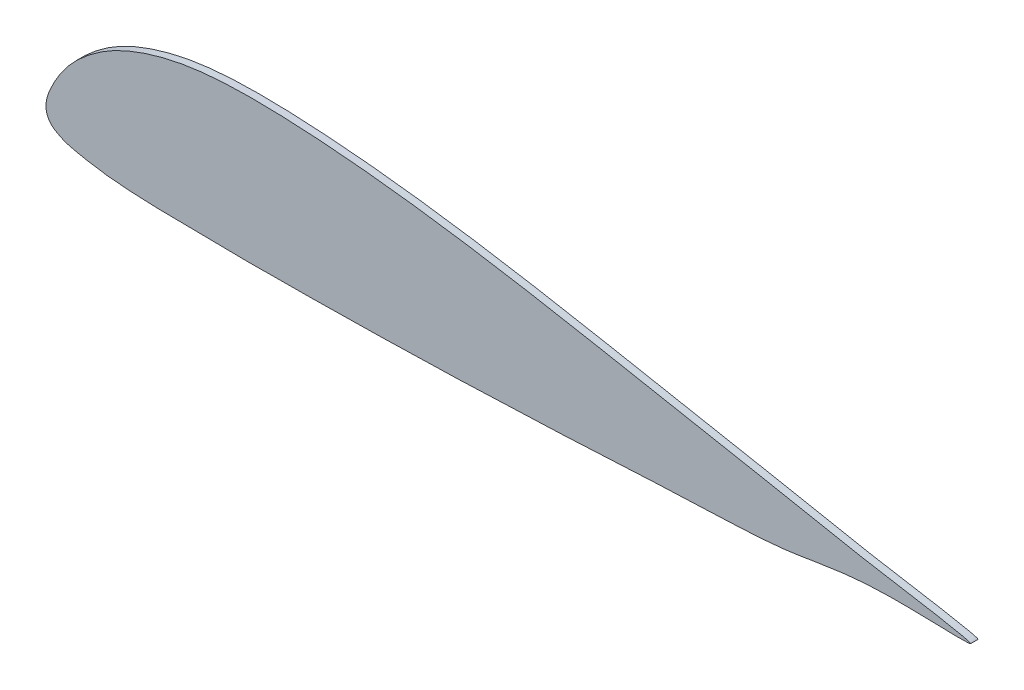
ISO-10303-21;
HEADER;
FILE_DESCRIPTION(('STEP AP214'),'2;1');
FILE_NAME('part.step','',(''),(''),'','','');
FILE_SCHEMA(('AUTOMOTIVE_DESIGN { 1 0 10303 214 1 1 1 1 }'));
ENDSEC;
DATA;
#1=APPLICATION_CONTEXT('core data for automotive mechanical design processes');
#2=APPLICATION_PROTOCOL_DEFINITION('international standard','automotive_design',2000,#1);
#3=PRODUCT_CONTEXT('',#1,'mechanical');
#4=PRODUCT('Part','Part','',(#3));
#5=PRODUCT_RELATED_PRODUCT_CATEGORY('part','',(#4));
#6=PRODUCT_DEFINITION_FORMATION('','',#4);
#7=PRODUCT_DEFINITION_CONTEXT('part definition',#1,'design');
#8=PRODUCT_DEFINITION('design','',#6,#7);
#9=PRODUCT_DEFINITION_SHAPE('','',#8);
#10=(LENGTH_UNIT() NAMED_UNIT(*) SI_UNIT(.MILLI.,.METRE.));
#11=(NAMED_UNIT(*) PLANE_ANGLE_UNIT() SI_UNIT($,.RADIAN.));
#12=(NAMED_UNIT(*) SI_UNIT($,.STERADIAN.) SOLID_ANGLE_UNIT());
#13=UNCERTAINTY_MEASURE_WITH_UNIT(LENGTH_MEASURE(1.E-05),#10,'distance_accuracy_value','');
#14=(GEOMETRIC_REPRESENTATION_CONTEXT(3) GLOBAL_UNCERTAINTY_ASSIGNED_CONTEXT((#13)) GLOBAL_UNIT_ASSIGNED_CONTEXT((#10,
#11,#12)) REPRESENTATION_CONTEXT('',''));
#15=CARTESIAN_POINT('',(0.,0.,0.));
#16=DIRECTION('',(0.,0.,1.));
#17=DIRECTION('',(1.,0.,0.));
#18=AXIS2_PLACEMENT_3D('',#15,#16,#17);
#19=CARTESIAN_POINT('',(0.,0.,4.));
#20=DIRECTION('',(0.,0.,1.));
#21=DIRECTION('',(1.,0.,0.));
#22=AXIS2_PLACEMENT_3D('',#19,#20,#21);
#23=PLANE('',#22);
#24=CARTESIAN_POINT('',(7.86642818865798,37.5600854439552,4.));
#25=CARTESIAN_POINT('',(9.349195933155,39.7790656142948,4.));
#26=CARTESIAN_POINT('',(12.1034873252235,43.4755174120012,4.));
#27=CARTESIAN_POINT('',(16.9159359850114,48.5150404115486,4.));
#28=CARTESIAN_POINT('',(21.6176664375762,52.7069461570158,4.));
#29=CARTESIAN_POINT('',(26.6421593711908,56.5455689477406,4.));
#30=CARTESIAN_POINT('',(31.6626790734477,59.9068258486715,4.));
#31=CARTESIAN_POINT('',(36.9892194583104,62.9566992776115,4.));
#32=CARTESIAN_POINT('',(42.8619342983418,65.7826347722417,4.));
#33=CARTESIAN_POINT('',(49.0168378634112,68.2730208695513,4.));
#34=CARTESIAN_POINT('',(55.447830013006,70.4815511522718,4.));
#35=CARTESIAN_POINT('',(61.4971824775569,72.2302159766422,4.));
#36=CARTESIAN_POINT('',(68.0467453758925,73.8176998488306,4.));
#37=CARTESIAN_POINT('',(74.3978940088024,75.0510161003253,4.));
#38=CARTESIAN_POINT('',(80.8824820776991,76.0082542537129,4.));
#39=CARTESIAN_POINT('',(86.7438296997499,76.6696660731231,4.));
#40=CARTESIAN_POINT('',(93.1858587450397,77.1992714433523,4.));
#41=CARTESIAN_POINT('',(100.873467483866,77.5954456385825,4.));
#42=CARTESIAN_POINT('',(109.531029416945,77.7729608456838,4.));
#43=CARTESIAN_POINT('',(119.540449473351,77.7055762504231,4.));
#44=CARTESIAN_POINT('',(130.116670866595,77.3864475790961,4.));
#45=CARTESIAN_POINT('',(141.13642380684,76.837588784259,4.));
#46=CARTESIAN_POINT('',(151.918170621868,76.1211915889756,4.));
#47=CARTESIAN_POINT('',(163.323143637899,75.2000149519219,4.));
#48=CARTESIAN_POINT('',(175.958123105388,73.986961570067,4.));
#49=CARTESIAN_POINT('',(190.05754678027,72.4144741651409,4.));
#50=CARTESIAN_POINT('',(206.582344436751,70.3224944013891,4.));
#51=CARTESIAN_POINT('',(223.84999875408,67.8567628620006,4.));
#52=CARTESIAN_POINT('',(240.490370609623,65.2434318976702,4.));
#53=CARTESIAN_POINT('',(253.817395036374,63.0165517950123,4.));
#54=CARTESIAN_POINT('',(268.670487025287,60.4320915434448,4.));
#55=CARTESIAN_POINT('',(285.232031151819,57.4255088951261,4.));
#56=CARTESIAN_POINT('',(303.893779285959,53.9257087932409,4.));
#57=CARTESIAN_POINT('',(320.011133364715,50.8601080714792,4.));
#58=CARTESIAN_POINT('',(334.611432617956,48.0737237896853,4.));
#59=CARTESIAN_POINT('',(347.931865552968,45.5390866245231,4.));
#60=CARTESIAN_POINT('',(362.655250182307,42.7653845916359,4.));
#61=CARTESIAN_POINT('',(376.820025472643,40.1027299479941,4.));
#62=CARTESIAN_POINT('',(391.306330775227,37.3495779188942,4.));
#63=CARTESIAN_POINT('',(404.141083587299,34.8486521829418,4.));
#64=CARTESIAN_POINT('',(419.345736353988,31.8103993496776,4.));
#65=CARTESIAN_POINT('',(436.363954130895,28.5257555347518,4.));
#66=CARTESIAN_POINT('',(455.999670421156,25.1096296023083,4.));
#67=CARTESIAN_POINT('',(476.567739047917,21.5773552750827,4.));
#68=CARTESIAN_POINT('',(486.734086076748,19.9980658019803,4.));
#69=CARTESIAN_POINT('',(503.19953596373,16.4828473280323,4.));
#70=CARTESIAN_POINT('',(494.0454434377,16.0789705033464,4.));
#71=CARTESIAN_POINT('',(487.893099972618,16.3456510718054,4.));
#72=CARTESIAN_POINT('',(477.38296715892,16.5667793245295,4.));
#73=CARTESIAN_POINT('',(465.767026362275,16.8137990808104,4.));
#74=CARTESIAN_POINT('',(452.74352490968,16.8186367949743,4.));
#75=CARTESIAN_POINT('',(439.174137539788,16.1147428039849,4.));
#76=CARTESIAN_POINT('',(425.264325471383,14.4642529434865,4.));
#77=CARTESIAN_POINT('',(412.041731394213,12.2109073669242,4.));
#78=CARTESIAN_POINT('',(396.927202205353,9.953910023902,4.));
#79=CARTESIAN_POINT('',(381.325737555321,8.81453684115407,4.));
#80=CARTESIAN_POINT('',(365.963725518706,8.18860884489088,4.));
#81=CARTESIAN_POINT('',(351.799027155226,7.70612388226326,4.));
#82=CARTESIAN_POINT('',(338.72259128266,7.14953840348512,4.));
#83=CARTESIAN_POINT('',(326.138738131588,6.50563477890456,4.));
#84=CARTESIAN_POINT('',(315.786058686714,5.95049010015145,4.));
#85=CARTESIAN_POINT('',(307.253260403638,5.49156980855069,4.));
#86=CARTESIAN_POINT('',(297.411514352509,4.97962602862121,4.));
#87=CARTESIAN_POINT('',(286.856508578636,4.47136369606796,4.));
#88=CARTESIAN_POINT('',(277.288264205225,4.04393621337987,4.));
#89=CARTESIAN_POINT('',(269.185495432717,3.6963464667102,4.));
#90=CARTESIAN_POINT('',(261.455408329635,3.37510162961061,4.));
#91=CARTESIAN_POINT('',(251.85847367848,2.9904005185695,4.));
#92=CARTESIAN_POINT('',(241.259764138997,2.57538695252416,4.));
#93=CARTESIAN_POINT('',(231.97931917217,2.22730813543466,4.));
#94=CARTESIAN_POINT('',(223.450553441865,1.92592357604687,4.));
#95=CARTESIAN_POINT('',(216.537698653368,1.69541028667778,4.));
#96=CARTESIAN_POINT('',(207.316113689005,1.41133055741081,4.));
#97=CARTESIAN_POINT('',(198.265588962476,1.16951598795194,4.));
#98=CARTESIAN_POINT('',(188.832044810454,0.960506400865428,4.));
#99=CARTESIAN_POINT('',(181.194391153829,0.811797962890729,4.));
#100=CARTESIAN_POINT('',(173.300774393552,0.674971798142655,4.));
#101=CARTESIAN_POINT('',(165.598027616176,0.553110888651061,4.));
#102=CARTESIAN_POINT('',(157.184877056438,0.427740206675201,4.));
#103=CARTESIAN_POINT('',(148.255486381539,0.296373140235194,4.));
#104=CARTESIAN_POINT('',(137.665890196127,0.139932701420909,4.));
#105=CARTESIAN_POINT('',(127.332975975454,0.0246894512117235,4.));
#106=CARTESIAN_POINT('',(116.035852958917,-0.0122939360525976,4.));
#107=CARTESIAN_POINT('',(106.2760960558,0.0230099384918485,4.));
#108=CARTESIAN_POINT('',(96.7774624087549,0.100882580030632,4.));
#109=CARTESIAN_POINT('',(88.6912158704019,0.18914004370334,4.));
#110=CARTESIAN_POINT('',(80.0667024231119,0.303091928359447,4.));
#111=CARTESIAN_POINT('',(71.5319385885235,0.422867632545606,4.));
#112=CARTESIAN_POINT('',(61.8978591166734,0.593225650239152,4.));
#113=CARTESIAN_POINT('',(53.0113701516594,0.862691355569765,4.));
#114=CARTESIAN_POINT('',(44.0349476770185,1.33412077346498,4.));
#115=CARTESIAN_POINT('',(36.2172914452283,1.95952021144231,4.));
#116=CARTESIAN_POINT('',(28.3052008260824,2.91165829366469,4.));
#117=CARTESIAN_POINT('',(21.1380626609549,4.15286774,4.));
#118=CARTESIAN_POINT('',(14.9806404589297,5.47597874074992,4.));
#119=CARTESIAN_POINT('',(10.1274482430046,6.70931718640755,4.));
#120=CARTESIAN_POINT('',(6.49526205462328,8.52310688643919,4.));
#121=CARTESIAN_POINT('',(3.41688364341468,10.3580600486565,4.));
#122=CARTESIAN_POINT('',(1.23618206270726,12.9218454266941,4.));
#123=CARTESIAN_POINT('',(0.0422916903364493,16.1496423344682,4.));
#124=CARTESIAN_POINT('',(-0.107746475681622,19.6682563157669,4.));
#125=CARTESIAN_POINT('',(0.84874716288435,24.1335431540118,4.));
#126=CARTESIAN_POINT('',(2.84809809058963,28.6746958250691,4.));
#127=CARTESIAN_POINT('',(5.205494886095,33.3883456706554,4.));
#128=CARTESIAN_POINT('',(6.93859153057243,36.171566471077,4.));
#129=CARTESIAN_POINT('',(7.86642818865798,37.5600854439552,4.));
#130=B_SPLINE_CURVE_WITH_KNOTS('',3,(#24,#25,#26,#27,#28,#29,#30,#31,#32,#33,#34,#35,#36,#37,
#38,#39,#40,#41,#42,#43,#44,#45,#46,#47,#48,#49,#50,#51,#52,#53,#54,#55,#56,#57,#58,#59,#60,#61,
#62,#63,#64,#65,#66,#67,#68,#69,#70,#71,#72,#73,#74,#75,#76,#77,#78,#79,#80,#81,#82,#83,#84,#85,
#86,#87,#88,#89,#90,#91,#92,#93,#94,#95,#96,#97,#98,#99,#100,#101,#102,#103,#104,#105,#106,#107,
#108,#109,#110,#111,#112,#113,#114,#115,#116,#117,#118,#119,#120,#121,#122,#123,#124,#125,#126,
#127,#128,#129),.UNSPECIFIED.,.T.,.F.,(4,1,1,1,1,1,1,1,1,1,1,1,1,1,1,1,1,1,1,1,1,1,1,1,1,1,1,1,
1,1,1,1,1,1,1,1,1,1,1,1,1,1,1,1,1,1,1,1,1,1,1,1,1,1,1,1,1,1,1,1,1,1,1,1,1,1,1,1,1,1,1,1,1,1,1,1,
1,1,1,1,1,1,1,1,1,1,1,1,1,1,1,1,1,1,1,1,1,1,1,1,1,1,1,4),(0.,0.00770697235470337,
0.0132882265489208,0.0201143121464451,0.0258932716103778,0.0315518965906807,0.0375663195534116,
0.0436184091143941,0.0503760137734859,0.056745984115085,0.0632649535575923,0.0685696268475672,
0.0762213431590591,0.0819558506627911,0.0875123859970355,0.0932680044431737,0.100636625052185,
0.109759073664857,0.118293518714106,0.129566794260679,0.140340402301577,0.150183662476812,
0.160798709594957,0.173412414770068,0.186871093706961,0.201803840898713,0.22155642795299,
0.237286489293352,0.250490924136068,0.26061142648175,0.280863818400143,0.299143426523571,
0.315492967610378,0.328285759759526,0.342106856472102,0.354686027268743,0.371592203373484,
0.383765331725917,0.397312234619457,0.409371574840389,0.428650667193576,0.447017705102968,
0.468574147879851,0.482904754889232,0.490873644478574,0.494014251499779,0.502595482342349,
0.5118452316674,0.523193048031028,0.536597071894935,0.549342877759212,0.562479896614475,
0.577046941202727,0.588116309420885,0.606637017505124,0.622219343293856,0.632561704986477,
0.647602331257877,0.660050175930447,0.668982327510262,0.677569471304082,0.684749623097394,
0.697468049623287,0.708113649637143,0.712433909824988,0.720910407862124,0.730476520089823,
0.740195846359556,0.75156914828378,0.757320212713816,0.764863378187476,0.771561639735525,
0.783987564310391,0.791032832128782,0.798835687504412,0.806068143162646,0.813852522067706,
0.821103036254469,0.830388814459076,0.839665457347813,0.851715326195977,0.860257388450223,
0.872319412761684,0.879925567160524,0.887713815822269,0.895693836283049,0.904856656379836,
0.912385681473604,0.923545255343281,0.930552380685221,0.938365914070942,0.946209281217896,
0.953580927755382,0.959372485765175,0.964436982029226,0.967974776707078,0.971074454254385,
0.974748022417145,0.977429749510792,0.980891008778815,0.98476849076222,0.990533763029307,
0.995177389378691,1.),.UNSPECIFIED.);
#131=CARTESIAN_POINT('',(7.86642818865798,37.5600854439552,4.));
#132=VERTEX_POINT('',#131);
#133=EDGE_CURVE('E10',#132,#132,#130,.T.);
#134=ORIENTED_EDGE('',*,*,#133,.F.);
#135=EDGE_LOOP('',(#134));
#136=FACE_BOUND('',#135,.T.);
#137=ADVANCED_FACE('F33',(#136),#23,.T.);
#138=DIRECTION('',(0.,0.,-1.));
#139=VECTOR('',#138,1.);
#140=SURFACE_OF_LINEAR_EXTRUSION('',#130,#139);
#141=ORIENTED_EDGE('',*,*,#133,.T.);
#142=EDGE_LOOP('',(#141));
#143=FACE_BOUND('',#142,.T.);
#144=CARTESIAN_POINT('',(7.86642818865798,37.5600854439552,0.));
#145=CARTESIAN_POINT('',(9.349195933155,39.7790656142948,0.));
#146=CARTESIAN_POINT('',(12.1034873252235,43.4755174120012,0.));
#147=CARTESIAN_POINT('',(16.9159359850114,48.5150404115486,0.));
#148=CARTESIAN_POINT('',(21.6176664375762,52.7069461570158,0.));
#149=CARTESIAN_POINT('',(26.6421593711908,56.5455689477406,0.));
#150=CARTESIAN_POINT('',(31.6626790734477,59.9068258486715,0.));
#151=CARTESIAN_POINT('',(36.9892194583104,62.9566992776115,0.));
#152=CARTESIAN_POINT('',(42.8619342983418,65.7826347722417,0.));
#153=CARTESIAN_POINT('',(49.0168378634112,68.2730208695513,0.));
#154=CARTESIAN_POINT('',(55.447830013006,70.4815511522718,0.));
#155=CARTESIAN_POINT('',(61.4971824775569,72.2302159766422,0.));
#156=CARTESIAN_POINT('',(68.0467453758925,73.8176998488306,0.));
#157=CARTESIAN_POINT('',(74.3978940088024,75.0510161003253,0.));
#158=CARTESIAN_POINT('',(80.8824820776991,76.0082542537129,0.));
#159=CARTESIAN_POINT('',(86.7438296997499,76.6696660731231,0.));
#160=CARTESIAN_POINT('',(93.1858587450397,77.1992714433523,0.));
#161=CARTESIAN_POINT('',(100.873467483866,77.5954456385825,0.));
#162=CARTESIAN_POINT('',(109.531029416945,77.7729608456838,0.));
#163=CARTESIAN_POINT('',(119.540449473351,77.7055762504231,0.));
#164=CARTESIAN_POINT('',(130.116670866595,77.3864475790961,0.));
#165=CARTESIAN_POINT('',(141.13642380684,76.837588784259,0.));
#166=CARTESIAN_POINT('',(151.918170621868,76.1211915889756,0.));
#167=CARTESIAN_POINT('',(163.323143637899,75.2000149519219,0.));
#168=CARTESIAN_POINT('',(175.958123105388,73.986961570067,0.));
#169=CARTESIAN_POINT('',(190.05754678027,72.4144741651409,0.));
#170=CARTESIAN_POINT('',(206.582344436751,70.3224944013891,0.));
#171=CARTESIAN_POINT('',(223.84999875408,67.8567628620006,0.));
#172=CARTESIAN_POINT('',(240.490370609623,65.2434318976702,0.));
#173=CARTESIAN_POINT('',(253.817395036374,63.0165517950123,0.));
#174=CARTESIAN_POINT('',(268.670487025287,60.4320915434448,0.));
#175=CARTESIAN_POINT('',(285.232031151819,57.4255088951261,0.));
#176=CARTESIAN_POINT('',(303.893779285959,53.9257087932409,0.));
#177=CARTESIAN_POINT('',(320.011133364715,50.8601080714792,0.));
#178=CARTESIAN_POINT('',(334.611432617956,48.0737237896853,0.));
#179=CARTESIAN_POINT('',(347.931865552968,45.5390866245231,0.));
#180=CARTESIAN_POINT('',(362.655250182307,42.7653845916359,0.));
#181=CARTESIAN_POINT('',(376.820025472643,40.1027299479941,0.));
#182=CARTESIAN_POINT('',(391.306330775227,37.3495779188942,0.));
#183=CARTESIAN_POINT('',(404.141083587299,34.8486521829418,0.));
#184=CARTESIAN_POINT('',(419.345736353988,31.8103993496776,0.));
#185=CARTESIAN_POINT('',(436.363954130895,28.5257555347518,0.));
#186=CARTESIAN_POINT('',(455.999670421156,25.1096296023083,0.));
#187=CARTESIAN_POINT('',(476.567739047917,21.5773552750827,0.));
#188=CARTESIAN_POINT('',(486.734086076748,19.9980658019803,0.));
#189=CARTESIAN_POINT('',(503.19953596373,16.4828473280323,0.));
#190=CARTESIAN_POINT('',(494.0454434377,16.0789705033464,0.));
#191=CARTESIAN_POINT('',(487.893099972618,16.3456510718054,0.));
#192=CARTESIAN_POINT('',(477.38296715892,16.5667793245295,0.));
#193=CARTESIAN_POINT('',(465.767026362275,16.8137990808104,0.));
#194=CARTESIAN_POINT('',(452.74352490968,16.8186367949743,0.));
#195=CARTESIAN_POINT('',(439.174137539788,16.1147428039849,0.));
#196=CARTESIAN_POINT('',(425.264325471383,14.4642529434865,0.));
#197=CARTESIAN_POINT('',(412.041731394213,12.2109073669242,0.));
#198=CARTESIAN_POINT('',(396.927202205353,9.953910023902,0.));
#199=CARTESIAN_POINT('',(381.325737555321,8.81453684115407,0.));
#200=CARTESIAN_POINT('',(365.963725518706,8.18860884489088,0.));
#201=CARTESIAN_POINT('',(351.799027155226,7.70612388226326,0.));
#202=CARTESIAN_POINT('',(338.72259128266,7.14953840348512,0.));
#203=CARTESIAN_POINT('',(326.138738131588,6.50563477890456,0.));
#204=CARTESIAN_POINT('',(315.786058686714,5.95049010015145,0.));
#205=CARTESIAN_POINT('',(307.253260403638,5.49156980855069,0.));
#206=CARTESIAN_POINT('',(297.411514352509,4.97962602862121,0.));
#207=CARTESIAN_POINT('',(286.856508578636,4.47136369606796,0.));
#208=CARTESIAN_POINT('',(277.288264205225,4.04393621337987,0.));
#209=CARTESIAN_POINT('',(269.185495432717,3.6963464667102,0.));
#210=CARTESIAN_POINT('',(261.455408329635,3.37510162961061,0.));
#211=CARTESIAN_POINT('',(251.85847367848,2.9904005185695,0.));
#212=CARTESIAN_POINT('',(241.259764138997,2.57538695252416,0.));
#213=CARTESIAN_POINT('',(231.97931917217,2.22730813543466,0.));
#214=CARTESIAN_POINT('',(223.450553441865,1.92592357604687,0.));
#215=CARTESIAN_POINT('',(216.537698653368,1.69541028667778,0.));
#216=CARTESIAN_POINT('',(207.316113689005,1.41133055741081,0.));
#217=CARTESIAN_POINT('',(198.265588962476,1.16951598795194,0.));
#218=CARTESIAN_POINT('',(188.832044810454,0.960506400865428,0.));
#219=CARTESIAN_POINT('',(181.194391153829,0.811797962890729,0.));
#220=CARTESIAN_POINT('',(173.300774393552,0.674971798142655,0.));
#221=CARTESIAN_POINT('',(165.598027616176,0.553110888651061,0.));
#222=CARTESIAN_POINT('',(157.184877056438,0.427740206675201,0.));
#223=CARTESIAN_POINT('',(148.255486381539,0.296373140235194,0.));
#224=CARTESIAN_POINT('',(137.665890196127,0.139932701420909,0.));
#225=CARTESIAN_POINT('',(127.332975975454,0.0246894512117235,0.));
#226=CARTESIAN_POINT('',(116.035852958917,-0.0122939360525976,0.));
#227=CARTESIAN_POINT('',(106.2760960558,0.0230099384918485,0.));
#228=CARTESIAN_POINT('',(96.7774624087549,0.100882580030632,0.));
#229=CARTESIAN_POINT('',(88.6912158704019,0.18914004370334,0.));
#230=CARTESIAN_POINT('',(80.0667024231119,0.303091928359447,0.));
#231=CARTESIAN_POINT('',(71.5319385885235,0.422867632545606,0.));
#232=CARTESIAN_POINT('',(61.8978591166734,0.593225650239152,0.));
#233=CARTESIAN_POINT('',(53.0113701516594,0.862691355569765,0.));
#234=CARTESIAN_POINT('',(44.0349476770185,1.33412077346498,0.));
#235=CARTESIAN_POINT('',(36.2172914452283,1.95952021144231,0.));
#236=CARTESIAN_POINT('',(28.3052008260824,2.91165829366469,0.));
#237=CARTESIAN_POINT('',(21.1380626609549,4.15286774,0.));
#238=CARTESIAN_POINT('',(14.9806404589297,5.47597874074992,0.));
#239=CARTESIAN_POINT('',(10.1274482430046,6.70931718640755,0.));
#240=CARTESIAN_POINT('',(6.49526205462328,8.52310688643919,0.));
#241=CARTESIAN_POINT('',(3.41688364341468,10.3580600486565,0.));
#242=CARTESIAN_POINT('',(1.23618206270726,12.9218454266941,0.));
#243=CARTESIAN_POINT('',(0.0422916903364493,16.1496423344682,0.));
#244=CARTESIAN_POINT('',(-0.107746475681622,19.6682563157669,0.));
#245=CARTESIAN_POINT('',(0.84874716288435,24.1335431540118,0.));
#246=CARTESIAN_POINT('',(2.84809809058963,28.6746958250691,0.));
#247=CARTESIAN_POINT('',(5.205494886095,33.3883456706554,0.));
#248=CARTESIAN_POINT('',(6.93859153057243,36.171566471077,0.));
#249=CARTESIAN_POINT('',(7.86642818865798,37.5600854439552,0.));
#250=B_SPLINE_CURVE_WITH_KNOTS('',3,(#144,#145,#146,#147,#148,#149,#150,#151,#152,#153,#154,
#155,#156,#157,#158,#159,#160,#161,#162,#163,#164,#165,#166,#167,#168,#169,#170,#171,#172,#173,
#174,#175,#176,#177,#178,#179,#180,#181,#182,#183,#184,#185,#186,#187,#188,#189,#190,#191,#192,
#193,#194,#195,#196,#197,#198,#199,#200,#201,#202,#203,#204,#205,#206,#207,#208,#209,#210,#211,
#212,#213,#214,#215,#216,#217,#218,#219,#220,#221,#222,#223,#224,#225,#226,#227,#228,#229,#230,
#231,#232,#233,#234,#235,#236,#237,#238,#239,#240,#241,#242,#243,#244,#245,#246,#247,#248,#249),
.UNSPECIFIED.,.T.,.F.,(4,1,1,1,1,1,1,1,1,1,1,1,1,1,1,1,1,1,1,1,1,1,1,1,1,1,1,1,1,1,1,1,1,1,1,1,
1,1,1,1,1,1,1,1,1,1,1,1,1,1,1,1,1,1,1,1,1,1,1,1,1,1,1,1,1,1,1,1,1,1,1,1,1,1,1,1,1,1,1,1,1,1,1,1,
1,1,1,1,1,1,1,1,1,1,1,1,1,1,1,1,1,1,1,4),(0.,0.00770697235470337,0.0132882265489208,
0.0201143121464451,0.0258932716103778,0.0315518965906807,0.0375663195534116,0.0436184091143941,
0.0503760137734859,0.056745984115085,0.0632649535575923,0.0685696268475672,0.0762213431590591,
0.0819558506627911,0.0875123859970355,0.0932680044431737,0.100636625052185,0.109759073664857,
0.118293518714106,0.129566794260679,0.140340402301577,0.150183662476812,0.160798709594957,
0.173412414770068,0.186871093706961,0.201803840898713,0.22155642795299,0.237286489293352,
0.250490924136068,0.26061142648175,0.280863818400143,0.299143426523571,0.315492967610378,
0.328285759759526,0.342106856472102,0.354686027268743,0.371592203373484,0.383765331725917,
0.397312234619457,0.409371574840389,0.428650667193576,0.447017705102968,0.468574147879851,
0.482904754889232,0.490873644478574,0.494014251499779,0.502595482342349,0.5118452316674,
0.523193048031028,0.536597071894935,0.549342877759212,0.562479896614475,0.577046941202727,
0.588116309420885,0.606637017505124,0.622219343293856,0.632561704986477,0.647602331257877,
0.660050175930447,0.668982327510262,0.677569471304082,0.684749623097394,0.697468049623287,
0.708113649637143,0.712433909824988,0.720910407862124,0.730476520089823,0.740195846359556,
0.75156914828378,0.757320212713816,0.764863378187476,0.771561639735525,0.783987564310391,
0.791032832128782,0.798835687504412,0.806068143162646,0.813852522067706,0.821103036254469,
0.830388814459076,0.839665457347813,0.851715326195977,0.860257388450223,0.872319412761684,
0.879925567160524,0.887713815822269,0.895693836283049,0.904856656379836,0.912385681473604,
0.923545255343281,0.930552380685221,0.938365914070942,0.946209281217896,0.953580927755382,
0.959372485765175,0.964436982029226,0.967974776707078,0.971074454254385,0.974748022417145,
0.977429749510792,0.980891008778815,0.98476849076222,0.990533763029307,0.995177389378691,1.),.UNSPECIFIED.);
#251=CARTESIAN_POINT('',(7.86642818865798,37.5600854439552,0.));
#252=VERTEX_POINT('',#251);
#253=EDGE_CURVE('E37',#252,#252,#250,.T.);
#254=ORIENTED_EDGE('',*,*,#253,.F.);
#255=EDGE_LOOP('',(#254));
#256=FACE_BOUND('',#255,.T.);
#257=ADVANCED_FACE('F53',(#143,#256),#140,.T.);
#258=CARTESIAN_POINT('',(0.,0.,0.));
#259=DIRECTION('',(0.,0.,1.));
#260=DIRECTION('',(1.,0.,0.));
#261=AXIS2_PLACEMENT_3D('',#258,#259,#260);
#262=PLANE('',#261);
#263=ORIENTED_EDGE('',*,*,#253,.T.);
#264=EDGE_LOOP('',(#263));
#265=FACE_BOUND('',#264,.T.);
#266=ADVANCED_FACE('F35',(#265),#262,.F.);
#267=CLOSED_SHELL('',(#137,#257,#266));
#268=MANIFOLD_SOLID_BREP('B2',#267);
#269=ADVANCED_BREP_SHAPE_REPRESENTATION('',(#18,#268),#14);
#270=SHAPE_DEFINITION_REPRESENTATION(#9,#269);
ENDSEC;
END-ISO-10303-21;
